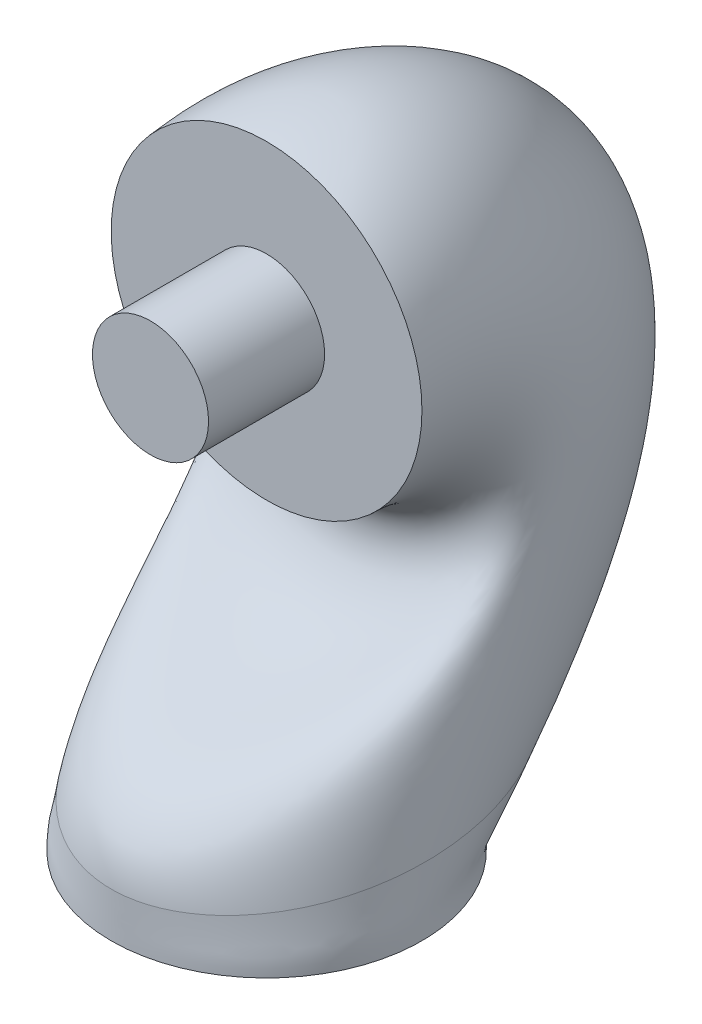
ISO-10303-21;
HEADER;
FILE_DESCRIPTION(('STEP AP214'),'2;1');
FILE_NAME('part.step','',(''),(''),'','','');
FILE_SCHEMA(('AUTOMOTIVE_DESIGN { 1 0 10303 214 1 1 1 1 }'));
ENDSEC;
DATA;
#1=APPLICATION_CONTEXT('core data for automotive mechanical design processes');
#2=APPLICATION_PROTOCOL_DEFINITION('international standard','automotive_design',2000,#1);
#3=PRODUCT_CONTEXT('',#1,'mechanical');
#4=PRODUCT('Part','Part','',(#3));
#5=PRODUCT_RELATED_PRODUCT_CATEGORY('part','',(#4));
#6=PRODUCT_DEFINITION_FORMATION('','',#4);
#7=PRODUCT_DEFINITION_CONTEXT('part definition',#1,'design');
#8=PRODUCT_DEFINITION('design','',#6,#7);
#9=PRODUCT_DEFINITION_SHAPE('','',#8);
#10=(LENGTH_UNIT() NAMED_UNIT(*) SI_UNIT(.MILLI.,.METRE.));
#11=(NAMED_UNIT(*) PLANE_ANGLE_UNIT() SI_UNIT($,.RADIAN.));
#12=(NAMED_UNIT(*) SI_UNIT($,.STERADIAN.) SOLID_ANGLE_UNIT());
#13=UNCERTAINTY_MEASURE_WITH_UNIT(LENGTH_MEASURE(1.E-05),#10,'distance_accuracy_value','');
#14=(GEOMETRIC_REPRESENTATION_CONTEXT(3) GLOBAL_UNCERTAINTY_ASSIGNED_CONTEXT((#13)) GLOBAL_UNIT_ASSIGNED_CONTEXT((#10,
#11,#12)) REPRESENTATION_CONTEXT('',''));
#15=CARTESIAN_POINT('',(0.,0.,0.));
#16=DIRECTION('',(0.,0.,1.));
#17=DIRECTION('',(1.,0.,0.));
#18=AXIS2_PLACEMENT_3D('',#15,#16,#17);
#19=CARTESIAN_POINT('',(0.,200.99,0.));
#20=DIRECTION('',(0.,0.,1.));
#21=DIRECTION('',(1.,0.,0.));
#22=AXIS2_PLACEMENT_3D('',#19,#20,#21);
#23=PLANE('',#22);
#24=CARTESIAN_POINT('',(0.,200.99,0.));
#25=DIRECTION('',(0.,0.,1.));
#26=DIRECTION('',(1.,0.,0.));
#27=AXIS2_PLACEMENT_3D('',#24,#25,#26);
#28=CIRCLE('',#27,25.4);
#29=CARTESIAN_POINT('',(25.4,200.99,0.));
#30=VERTEX_POINT('',#29);
#31=EDGE_CURVE('E184',#30,#30,#28,.T.);
#32=ORIENTED_EDGE('',*,*,#31,.F.);
#33=EDGE_LOOP('',(#32));
#34=FACE_BOUND('',#33,.T.);
#35=CARTESIAN_POINT('',(0.,200.99,0.));
#36=DIRECTION('',(0.,0.,1.));
#37=DIRECTION('',(1.,0.,0.));
#38=AXIS2_PLACEMENT_3D('',#35,#36,#37);
#39=CIRCLE('',#38,68.);
#40=CARTESIAN_POINT('',(68.,200.99,0.));
#41=VERTEX_POINT('',#40);
#42=EDGE_CURVE('E12',#41,#41,#39,.T.);
#43=ORIENTED_EDGE('',*,*,#42,.T.);
#44=EDGE_LOOP('',(#43));
#45=FACE_BOUND('',#44,.T.);
#46=ADVANCED_FACE('F90',(#34,#45),#23,.T.);
#47=CARTESIAN_POINT('',(0.,0.,0.));
#48=DIRECTION('',(0.,1.,0.));
#49=DIRECTION('',(0.,0.,1.));
#50=AXIS2_PLACEMENT_3D('',#47,#48,#49);
#51=PLANE('',#50);
#52=CARTESIAN_POINT('',(0.,0.,0.));
#53=DIRECTION('',(0.,-1.,0.));
#54=DIRECTION('',(0.,0.,-1.));
#55=AXIS2_PLACEMENT_3D('',#52,#53,#54);
#56=CIRCLE('',#55,25.4);
#57=CARTESIAN_POINT('',(0.,0.,-25.4));
#58=VERTEX_POINT('',#57);
#59=EDGE_CURVE('E191',#58,#58,#56,.T.);
#60=ORIENTED_EDGE('',*,*,#59,.F.);
#61=EDGE_LOOP('',(#60));
#62=FACE_BOUND('',#61,.T.);
#63=CARTESIAN_POINT('',(0.,0.,0.));
#64=DIRECTION('',(0.,1.,0.));
#65=DIRECTION('',(0.,0.,1.));
#66=AXIS2_PLACEMENT_3D('',#63,#64,#65);
#67=CIRCLE('',#66,68.);
#68=CARTESIAN_POINT('',(0.,0.,68.));
#69=VERTEX_POINT('',#68);
#70=EDGE_CURVE('E103',#69,#69,#67,.T.);
#71=ORIENTED_EDGE('',*,*,#70,.F.);
#72=EDGE_LOOP('',(#71));
#73=FACE_BOUND('',#72,.T.);
#74=ADVANCED_FACE('F125',(#62,#73),#51,.F.);
#75=CARTESIAN_POINT('',(0.,40.1830339897278,-96.0895319256657));
#76=CARTESIAN_POINT('',(0.,85.6169492294122,-136.561514064275));
#77=CARTESIAN_POINT('',(0.,175.500807488298,-166.280522660287));
#78=CARTESIAN_POINT('',(0.,263.314951672969,-100.602527009767));
#79=CARTESIAN_POINT('',(0.,276.247121590629,-29.9456852514251));
#80=CARTESIAN_POINT('',(0.,268.99,0.));
#81=CARTESIAN_POINT('',(-4.45058955707017,40.1830339897278,-96.0895319256657));
#82=CARTESIAN_POINT('',(-4.45058955707017,85.6169492294122,-136.561514064275));
#83=CARTESIAN_POINT('',(-4.45058955707018,175.500807488298,-166.280522660287));
#84=CARTESIAN_POINT('',(-4.4505895570702,263.314951672969,-100.602527009767));
#85=CARTESIAN_POINT('',(-4.4505895570702,276.247121590629,-29.9456852514251));
#86=CARTESIAN_POINT('',(-4.45058955707021,268.99,0.));
#87=CARTESIAN_POINT('',(-13.3516971290209,40.036933827057,-94.9791059748546));
#88=CARTESIAN_POINT('',(-13.3516971290209,85.3304325369103,-135.131594699005));
#89=CARTESIAN_POINT('',(-13.351697129021,174.699350374713,-164.853039748497));
#90=CARTESIAN_POINT('',(-13.351697129021,262.003810315437,-100.135902480789));
#91=CARTESIAN_POINT('',(-13.351697129021,275.278048891622,-30.0318807760566));
#92=CARTESIAN_POINT('',(-13.351697129021,268.113554910038,0.));
#93=CARTESIAN_POINT('',(-26.1902773929208,39.4124524652334,-90.141064573548));
#94=CARTESIAN_POINT('',(-26.1902773929208,84.0987651464168,-129.003610806172));
#95=CARTESIAN_POINT('',(-26.1902773929208,171.284518433549,-158.79414153997));
#96=CARTESIAN_POINT('',(-26.1902773929209,256.400686083253,-98.1263898861048));
#97=CARTESIAN_POINT('',(-26.1902773929209,271.028080934237,-30.3606278441287));
#98=CARTESIAN_POINT('',(-26.1902773929209,264.218866368927,0.));
#99=CARTESIAN_POINT('',(-38.0223754946656,38.423503782077,-82.3826791433597));
#100=CARTESIAN_POINT('',(-38.0223754946656,82.1408770972173,-119.282238847177));
#101=CARTESIAN_POINT('',(-38.0223754946656,165.888139871942,-149.24404729991));
#102=CARTESIAN_POINT('',(-38.0223754946656,247.528597135227,-94.9282411677369));
#103=CARTESIAN_POINT('',(-38.0223754946656,264.183990341426,-30.8393963104029));
#104=CARTESIAN_POINT('',(-38.0223754946656,257.894548780521,0.));
#105=CARTESIAN_POINT('',(-48.3933075192374,37.1181618146429,-72.0411153085146));
#106=CARTESIAN_POINT('',(-48.3933075192374,79.5488928343094,-106.433060267412));
#107=CARTESIAN_POINT('',(-48.3933075192375,158.777276446469,-136.685590149981));
#108=CARTESIAN_POINT('',(-48.3933075192375,235.81932211697,-90.6903822562369));
#109=CARTESIAN_POINT('',(-48.3933075192376,255.031471100156,-31.4276134970264));
#110=CARTESIAN_POINT('',(-48.3933075192376,249.383311422279,0.));
#111=CARTESIAN_POINT('',(-56.9045112462352,35.5511033989887,-59.5314758417417));
#112=CARTESIAN_POINT('',(-56.9045112462352,76.4300034586772,-90.9911298037877));
#113=CARTESIAN_POINT('',(-56.9045112462351,150.251922318227,-121.653210754833));
#114=CARTESIAN_POINT('',(-56.9045112462351,221.763551128121,-85.5873675756419));
#115=CARTESIAN_POINT('',(-56.9045112462351,243.932643843936,-32.092820027114));
#116=CARTESIAN_POINT('',(-56.9045112462351,239.012403519171,0.));
#117=CARTESIAN_POINT('',(-63.2289105718552,33.7825667868715,-45.3345085371011));
#118=CARTESIAN_POINT('',(-63.2289105718552,72.9040904374828,-73.5500182640686));
#119=CARTESIAN_POINT('',(-63.2289105718552,140.639810004648,-104.724817859811));
#120=CARTESIAN_POINT('',(-63.2289105718553,205.901594298424,-79.8153379569059));
#121=CARTESIAN_POINT('',(-63.2289105718553,231.31400195968,-32.8093902074001));
#122=CARTESIAN_POINT('',(-63.2289105718553,227.180280733188,0.));
#123=CARTESIAN_POINT('',(-67.1234564131867,31.877187026382,-29.9828594470392));
#124=CARTESIAN_POINT('',(-67.1234564131867,69.1010681069449,-54.7495586416824));
#125=CARTESIAN_POINT('',(-67.1234564131866,130.290601673814,-86.5126856143312));
#126=CARTESIAN_POINT('',(-67.1234564131866,188.812990827742,-73.5875002155936));
#127=CARTESIAN_POINT('',(-67.1234564131866,217.652931251162,-33.5571009824889));
#128=CARTESIAN_POINT('',(-67.1234564131866,214.341693781057,0.));
#129=CARTESIAN_POINT('',(-68.438484371331,29.9026144472948,-14.0447659628329));
#130=CARTESIAN_POINT('',(-68.438484371331,65.1577312507736,-35.2613101030782));
#131=CARTESIAN_POINT('',(-68.438484371331,119.568998642528,-67.6526556395998));
#132=CARTESIAN_POINT('',(-68.438484371331,171.104182844263,-67.1287648594481));
#133=CARTESIAN_POINT('',(-68.438484371331,203.461719064277,-34.3194343753628));
#134=CARTESIAN_POINT('',(-68.438484371331,200.989999999999,0.));
#135=CARTESIAN_POINT('',(-67.1234564131866,27.9280418682081,1.89332752137353));
#136=CARTESIAN_POINT('',(-67.1234564131866,61.2143943946031,-15.7730615644738));
#137=CARTESIAN_POINT('',(-67.1234564131866,108.847395611244,-48.7926256648683));
#138=CARTESIAN_POINT('',(-67.1234564131866,153.395374860787,-60.6700295033025));
#139=CARTESIAN_POINT('',(-67.1234564131866,189.270506877397,-35.0817677682366));
#140=CARTESIAN_POINT('',(-67.1234564131866,187.638306218945,0.));
#141=CARTESIAN_POINT('',(-63.2289105718554,26.0226621077182,17.2449766114353));
#142=CARTESIAN_POINT('',(-63.2289105718554,57.4113720640644,3.02739805791228));
#143=CARTESIAN_POINT('',(-63.2289105718554,98.4981872804083,-30.5804934193886));
#144=CARTESIAN_POINT('',(-63.2289105718555,136.306771390102,-54.4421917619902));
#145=CARTESIAN_POINT('',(-63.2289105718555,175.609436168875,-35.8294785433254));
#146=CARTESIAN_POINT('',(-63.2289105718555,174.799719266809,0.));
#147=CARTESIAN_POINT('',(-56.904511246235,24.2541254956013,31.4419439160761));
#148=CARTESIAN_POINT('',(-56.904511246235,53.8854590428706,20.4685095976315));
#149=CARTESIAN_POINT('',(-56.9045112462349,88.8860749668305,-13.6521005243662));
#150=CARTESIAN_POINT('',(-56.9045112462349,120.444814560407,-48.6701621432541));
#151=CARTESIAN_POINT('',(-56.9045112462349,162.990794284621,-36.5460487236115));
#152=CARTESIAN_POINT('',(-56.9045112462349,162.96759648083,0.));
#153=CARTESIAN_POINT('',(-48.3933075192375,22.687067079947,43.951583382849));
#154=CARTESIAN_POINT('',(-48.3933075192375,50.7665696672381,35.9104400612552));
#155=CARTESIAN_POINT('',(-48.3933075192375,80.3607208385881,1.38027887078156));
#156=CARTESIAN_POINT('',(-48.3933075192375,106.389043571557,-43.5671474626592));
#157=CARTESIAN_POINT('',(-48.3933075192375,151.8919670284,-37.2112552536991));
#158=CARTESIAN_POINT('',(-48.3933075192376,152.59668857772,0.));
#159=CARTESIAN_POINT('',(-38.0223754946655,21.381725112513,54.293147217694));
#160=CARTESIAN_POINT('',(-38.0223754946655,48.1745854043305,48.7596186410204));
#161=CARTESIAN_POINT('',(-38.0223754946655,73.2498574131158,13.9387360207104));
#162=CARTESIAN_POINT('',(-38.0223754946656,94.679768553301,-39.3292885511592));
#163=CARTESIAN_POINT('',(-38.0223754946656,142.739447787131,-37.7994724403226));
#164=CARTESIAN_POINT('',(-38.0223754946656,144.08545121948,0.));
#165=CARTESIAN_POINT('',(-26.1902773929209,20.3927764293566,62.0515326478822));
#166=CARTESIAN_POINT('',(-26.1902773929209,46.2166973551309,58.4809906000152));
#167=CARTESIAN_POINT('',(-26.1902773929209,67.8534788515089,23.4888302607699));
#168=CARTESIAN_POINT('',(-26.1902773929209,85.807679605274,-36.1311398327913));
#169=CARTESIAN_POINT('',(-26.1902773929209,135.89535719432,-38.2782409065967));
#170=CARTESIAN_POINT('',(-26.1902773929209,137.761133631073,0.));
#171=CARTESIAN_POINT('',(-13.351697129021,19.7682950675328,66.889574049189));
#172=CARTESIAN_POINT('',(-13.3516971290211,44.9850299646373,64.608974492849));
#173=CARTESIAN_POINT('',(-13.3516971290211,64.4386469103445,29.5477284692972));
#174=CARTESIAN_POINT('',(-13.3516971290212,80.2045553730899,-34.1216272381066));
#175=CARTESIAN_POINT('',(-13.3516971290212,131.645389236934,-38.6069879746688));
#176=CARTESIAN_POINT('',(-13.3516971290212,133.866445089962,0.));
#177=CARTESIAN_POINT('',(-4.4505895570702,19.6221949048621,68.));
#178=CARTESIAN_POINT('',(-4.4505895570702,44.6985132721355,66.0388938581191));
#179=CARTESIAN_POINT('',(-4.4505895570702,63.6371897967597,30.9752113810878));
#180=CARTESIAN_POINT('',(-4.4505895570702,78.8934140155578,-33.6550027091293));
#181=CARTESIAN_POINT('',(-4.4505895570702,130.676316537927,-38.6931834993003));
#182=CARTESIAN_POINT('',(-4.45058955707021,132.99,0.));
#183=CARTESIAN_POINT('',(4.45058955707018,19.6221949048621,68.));
#184=CARTESIAN_POINT('',(4.45058955707018,44.6985132721355,66.0388938581191));
#185=CARTESIAN_POINT('',(4.45058955707018,63.6371897967597,30.9752113810878));
#186=CARTESIAN_POINT('',(4.45058955707019,78.8934140155578,-33.6550027091293));
#187=CARTESIAN_POINT('',(4.45058955707019,130.676316537927,-38.6931834993003));
#188=CARTESIAN_POINT('',(4.45058955707018,132.99,0.));
#189=CARTESIAN_POINT('',(13.351697129021,19.7682950675328,66.8895740491891));
#190=CARTESIAN_POINT('',(13.351697129021,44.9850299646373,64.6089744928491));
#191=CARTESIAN_POINT('',(13.351697129021,64.4386469103444,29.5477284692972));
#192=CARTESIAN_POINT('',(13.351697129021,80.2045553730896,-34.1216272381066));
#193=CARTESIAN_POINT('',(13.3516971290209,131.645389236933,-38.6069879746688));
#194=CARTESIAN_POINT('',(13.3516971290209,133.866445089962,0.));
#195=CARTESIAN_POINT('',(26.1902773929206,20.3927764293566,62.051532647882));
#196=CARTESIAN_POINT('',(26.1902773929207,46.2166973551309,58.480990600015));
#197=CARTESIAN_POINT('',(26.1902773929207,67.853478851509,23.4888302607698));
#198=CARTESIAN_POINT('',(26.1902773929208,85.8076796052742,-36.1311398327914));
#199=CARTESIAN_POINT('',(26.1902773929208,135.89535719432,-38.2782409065967));
#200=CARTESIAN_POINT('',(26.1902773929208,137.761133631074,0.));
#201=CARTESIAN_POINT('',(38.0223754946657,21.3817251125129,54.2931472176944));
#202=CARTESIAN_POINT('',(38.0223754946657,48.1745854043304,48.7596186410207));
#203=CARTESIAN_POINT('',(38.0223754946657,73.2498574131156,13.9387360207106));
#204=CARTESIAN_POINT('',(38.0223754946656,94.6797685533006,-39.3292885511591));
#205=CARTESIAN_POINT('',(38.0223754946656,142.739447787131,-37.7994724403225));
#206=CARTESIAN_POINT('',(38.0223754946655,144.085451219479,0.));
#207=CARTESIAN_POINT('',(48.3933075192373,22.687067079947,43.9515833828487));
#208=CARTESIAN_POINT('',(48.3933075192373,50.7665696672381,35.910440061255));
#209=CARTESIAN_POINT('',(48.3933075192374,80.3607208385883,1.38027887078134));
#210=CARTESIAN_POINT('',(48.3933075192374,106.389043571557,-43.5671474626593));
#211=CARTESIAN_POINT('',(48.3933075192375,151.8919670284,-37.2112552536991));
#212=CARTESIAN_POINT('',(48.3933075192375,152.596688577721,0.));
#213=CARTESIAN_POINT('',(56.9045112462352,24.2541254956013,31.4419439160763));
#214=CARTESIAN_POINT('',(56.9045112462352,53.8854590428707,20.4685095976317));
#215=CARTESIAN_POINT('',(56.9045112462351,88.8860749668305,-13.6521005243661));
#216=CARTESIAN_POINT('',(56.9045112462351,120.444814560407,-48.6701621432541));
#217=CARTESIAN_POINT('',(56.9045112462351,162.990794284621,-36.5460487236114));
#218=CARTESIAN_POINT('',(56.904511246235,162.96759648083,0.));
#219=CARTESIAN_POINT('',(63.2289105718551,26.0226621077182,17.2449766114353));
#220=CARTESIAN_POINT('',(63.2289105718551,57.4113720640644,3.02739805791222));
#221=CARTESIAN_POINT('',(63.2289105718552,98.4981872804084,-30.5804934193887));
#222=CARTESIAN_POINT('',(63.2289105718553,136.306771390102,-54.4421917619903));
#223=CARTESIAN_POINT('',(63.2289105718553,175.609436168875,-35.8294785433254));
#224=CARTESIAN_POINT('',(63.2289105718554,174.799719266809,0.));
#225=CARTESIAN_POINT('',(67.1234564131868,27.928041868208,1.89332752137361));
#226=CARTESIAN_POINT('',(67.1234564131868,61.214394394603,-15.7730615644738));
#227=CARTESIAN_POINT('',(67.1234564131867,108.847395611244,-48.7926256648683));
#228=CARTESIAN_POINT('',(67.1234564131866,153.395374860786,-60.6700295033025));
#229=CARTESIAN_POINT('',(67.1234564131865,189.270506877396,-35.0817677682366));
#230=CARTESIAN_POINT('',(67.1234564131865,187.638306218945,0.));
#231=CARTESIAN_POINT('',(68.4384843713309,29.9026144472949,-14.0447659628328));
#232=CARTESIAN_POINT('',(68.4384843713309,65.1577312507737,-35.2613101030782));
#233=CARTESIAN_POINT('',(68.4384843713309,119.568998642529,-67.6526556395999));
#234=CARTESIAN_POINT('',(68.438484371331,171.104182844263,-67.1287648594481));
#235=CARTESIAN_POINT('',(68.4384843713311,203.461719064278,-34.3194343753627));
#236=CARTESIAN_POINT('',(68.4384843713311,200.99,0.));
#237=CARTESIAN_POINT('',(67.1234564131867,31.877187026382,-29.9828594470391));
#238=CARTESIAN_POINT('',(67.1234564131867,69.1010681069448,-54.7495586416824));
#239=CARTESIAN_POINT('',(67.1234564131866,130.290601673814,-86.5126856143312));
#240=CARTESIAN_POINT('',(67.1234564131866,188.812990827742,-73.5875002155937));
#241=CARTESIAN_POINT('',(67.1234564131865,217.652931251161,-33.5571009824889));
#242=CARTESIAN_POINT('',(67.1234564131865,214.341693781057,0.));
#243=CARTESIAN_POINT('',(63.2289105718552,33.7825667868716,-45.334508537101));
#244=CARTESIAN_POINT('',(63.2289105718553,72.9040904374831,-73.5500182640686));
#245=CARTESIAN_POINT('',(63.2289105718553,140.639810004649,-104.724817859811));
#246=CARTESIAN_POINT('',(63.2289105718554,205.901594298424,-79.815337956906));
#247=CARTESIAN_POINT('',(63.2289105718555,231.314001959681,-32.8093902074001));
#248=CARTESIAN_POINT('',(63.2289105718555,227.18028073319,0.));
#249=CARTESIAN_POINT('',(56.9045112462353,35.5511033989886,-59.5314758417416));
#250=CARTESIAN_POINT('',(56.9045112462352,76.4300034586771,-90.9911298037876));
#251=CARTESIAN_POINT('',(56.9045112462351,150.251922318227,-121.653210754833));
#252=CARTESIAN_POINT('',(56.904511246235,221.76355112812,-85.587367575642));
#253=CARTESIAN_POINT('',(56.9045112462349,243.932643843936,-32.092820027114));
#254=CARTESIAN_POINT('',(56.9045112462349,239.01240351917,0.));
#255=CARTESIAN_POINT('',(48.3933075192374,37.118161814643,-72.0411153085143));
#256=CARTESIAN_POINT('',(48.3933075192374,79.5488928343096,-106.433060267411));
#257=CARTESIAN_POINT('',(48.3933075192375,158.77727644647,-136.685590149981));
#258=CARTESIAN_POINT('',(48.3933075192375,235.819322116971,-90.6903822562369));
#259=CARTESIAN_POINT('',(48.3933075192376,255.031471100157,-31.4276134970264));
#260=CARTESIAN_POINT('',(48.3933075192376,249.38331142228,0.));
#261=CARTESIAN_POINT('',(38.0223754946659,38.4235037820769,-82.3826791433598));
#262=CARTESIAN_POINT('',(38.0223754946659,82.140877097217,-119.282238847177));
#263=CARTESIAN_POINT('',(38.0223754946658,165.888139871941,-149.24404729991));
#264=CARTESIAN_POINT('',(38.0223754946656,247.528597135226,-94.928241167737));
#265=CARTESIAN_POINT('',(38.0223754946655,264.183990341425,-30.8393963104029));
#266=CARTESIAN_POINT('',(38.0223754946655,257.89454878052,0.));
#267=CARTESIAN_POINT('',(26.1902773929207,39.4124524652334,-90.1410645735476));
#268=CARTESIAN_POINT('',(26.1902773929207,84.0987651464169,-129.003610806171));
#269=CARTESIAN_POINT('',(26.1902773929208,171.284518433549,-158.794141539969));
#270=CARTESIAN_POINT('',(26.1902773929208,256.400686083254,-98.1263898861048));
#271=CARTESIAN_POINT('',(26.1902773929209,271.028080934238,-30.3606278441287));
#272=CARTESIAN_POINT('',(26.1902773929209,264.218866368928,0.));
#273=CARTESIAN_POINT('',(13.3516971290213,40.036933827057,-94.9791059748548));
#274=CARTESIAN_POINT('',(13.3516971290213,85.3304325369102,-135.131594699005));
#275=CARTESIAN_POINT('',(13.3516971290212,174.699350374713,-164.853039748497));
#276=CARTESIAN_POINT('',(13.3516971290211,262.003810315437,-100.13590248079));
#277=CARTESIAN_POINT('',(13.3516971290211,275.278048891622,-30.0318807760566));
#278=CARTESIAN_POINT('',(13.351697129021,268.113554910037,0.));
#279=CARTESIAN_POINT('',(4.45058955707022,40.1830339897278,-96.0895319256657));
#280=CARTESIAN_POINT('',(4.45058955707022,85.6169492294122,-136.561514064275));
#281=CARTESIAN_POINT('',(4.45058955707022,175.500807488298,-166.280522660287));
#282=CARTESIAN_POINT('',(4.4505895570702,263.314951672969,-100.602527009767));
#283=CARTESIAN_POINT('',(4.4505895570702,276.247121590629,-29.9456852514251));
#284=CARTESIAN_POINT('',(4.4505895570702,268.99,0.));
#285=CARTESIAN_POINT('',(0.,40.1830339897278,-96.0895319256657));
#286=CARTESIAN_POINT('',(0.,85.6169492294122,-136.561514064275));
#287=CARTESIAN_POINT('',(0.,175.500807488298,-166.280522660287));
#288=CARTESIAN_POINT('',(0.,263.314951672969,-100.602527009767));
#289=CARTESIAN_POINT('',(0.,276.247121590629,-29.9456852514251));
#290=CARTESIAN_POINT('',(0.,268.99,0.));
#291=B_SPLINE_SURFACE_WITH_KNOTS('',3,3,((#75,#76,#77,#78,#79,#80),(#81,#82,#83,#84,#85,#86),
(#87,#88,#89,#90,#91,#92),(#93,#94,#95,#96,#97,#98),(#99,#100,#101,#102,#103,#104),(#105,#106,
#107,#108,#109,#110),(#111,#112,#113,#114,#115,#116),(#117,#118,#119,#120,#121,#122),(#123,#124,
#125,#126,#127,#128),(#129,#130,#131,#132,#133,#134),(#135,#136,#137,#138,#139,#140),(#141,#142,
#143,#144,#145,#146),(#147,#148,#149,#150,#151,#152),(#153,#154,#155,#156,#157,#158),(#159,#160,
#161,#162,#163,#164),(#165,#166,#167,#168,#169,#170),(#171,#172,#173,#174,#175,#176),(#177,#178,
#179,#180,#181,#182),(#183,#184,#185,#186,#187,#188),(#189,#190,#191,#192,#193,#194),(#195,#196,
#197,#198,#199,#200),(#201,#202,#203,#204,#205,#206),(#207,#208,#209,#210,#211,#212),(#213,#214,
#215,#216,#217,#218),(#219,#220,#221,#222,#223,#224),(#225,#226,#227,#228,#229,#230),(#231,#232,
#233,#234,#235,#236),(#237,#238,#239,#240,#241,#242),(#243,#244,#245,#246,#247,#248),(#249,#250,
#251,#252,#253,#254),(#255,#256,#257,#258,#259,#260),(#261,#262,#263,#264,#265,#266),(#267,#268,
#269,#270,#271,#272),(#273,#274,#275,#276,#277,#278),(#279,#280,#281,#282,#283,#284),(#285,#286,
#287,#288,#289,#290)),.UNSPECIFIED.,.T.,.F.,.F.,(4,1,1,1,1,1,1,1,1,1,1,1,1,1,1,1,2,1,1,1,1,1,1,
1,1,1,1,1,1,1,1,1,4),(4,1,1,4),(0.,0.03125,0.0625,0.09375,0.125,0.15625,0.1875,0.21875,0.25,
0.28125,0.3125,0.34375,0.375,0.40625,0.4375,0.46875,0.5,0.53125,0.5625,0.59375,0.625,0.65625,
0.6875,0.71875,0.75,0.78125,0.8125,0.84375,0.875,0.90625,0.9375,0.96875,1.),(0.0781027099836669,
0.378452682969865,0.712089921738431,1.),.UNSPECIFIED.);
#292=CARTESIAN_POINT('',(0.,40.1830339897278,-96.0895319256657));
#293=CARTESIAN_POINT('',(-4.45058955707017,40.1830339897278,-96.0895319256657));
#294=CARTESIAN_POINT('',(-13.3516971290209,40.036933827057,-94.9791059748546));
#295=CARTESIAN_POINT('',(-26.1902773929208,39.4124524652334,-90.141064573548));
#296=CARTESIAN_POINT('',(-38.0223754946656,38.423503782077,-82.3826791433597));
#297=CARTESIAN_POINT('',(-48.3933075192374,37.1181618146429,-72.0411153085146));
#298=CARTESIAN_POINT('',(-56.9045112462352,35.5511033989887,-59.5314758417417));
#299=CARTESIAN_POINT('',(-63.2289105718552,33.7825667868715,-45.3345085371011));
#300=CARTESIAN_POINT('',(-67.1234564131867,31.877187026382,-29.9828594470392));
#301=CARTESIAN_POINT('',(-68.438484371331,29.9026144472948,-14.0447659628329));
#302=CARTESIAN_POINT('',(-67.1234564131866,27.9280418682081,1.89332752137353));
#303=CARTESIAN_POINT('',(-63.2289105718554,26.0226621077182,17.2449766114353));
#304=CARTESIAN_POINT('',(-56.904511246235,24.2541254956013,31.4419439160761));
#305=CARTESIAN_POINT('',(-48.3933075192375,22.687067079947,43.951583382849));
#306=CARTESIAN_POINT('',(-38.0223754946655,21.381725112513,54.293147217694));
#307=CARTESIAN_POINT('',(-26.1902773929209,20.3927764293566,62.0515326478822));
#308=CARTESIAN_POINT('',(-13.351697129021,19.7682950675328,66.889574049189));
#309=CARTESIAN_POINT('',(-4.4505895570702,19.6221949048621,68.));
#310=CARTESIAN_POINT('',(4.45058955707018,19.6221949048621,68.));
#311=CARTESIAN_POINT('',(13.351697129021,19.7682950675328,66.8895740491891));
#312=CARTESIAN_POINT('',(26.1902773929206,20.3927764293566,62.051532647882));
#313=CARTESIAN_POINT('',(38.0223754946657,21.3817251125129,54.2931472176944));
#314=CARTESIAN_POINT('',(48.3933075192373,22.687067079947,43.9515833828487));
#315=CARTESIAN_POINT('',(56.9045112462352,24.2541254956013,31.4419439160763));
#316=CARTESIAN_POINT('',(63.2289105718551,26.0226621077182,17.2449766114353));
#317=CARTESIAN_POINT('',(67.1234564131868,27.928041868208,1.89332752137361));
#318=CARTESIAN_POINT('',(68.4384843713309,29.9026144472949,-14.0447659628328));
#319=CARTESIAN_POINT('',(67.1234564131867,31.877187026382,-29.9828594470391));
#320=CARTESIAN_POINT('',(63.2289105718552,33.7825667868716,-45.334508537101));
#321=CARTESIAN_POINT('',(56.9045112462353,35.5511033989886,-59.5314758417416));
#322=CARTESIAN_POINT('',(48.3933075192374,37.118161814643,-72.0411153085143));
#323=CARTESIAN_POINT('',(38.0223754946659,38.4235037820769,-82.3826791433598));
#324=CARTESIAN_POINT('',(26.1902773929207,39.4124524652334,-90.1410645735476));
#325=CARTESIAN_POINT('',(13.3516971290213,40.036933827057,-94.9791059748548));
#326=CARTESIAN_POINT('',(4.45058955707022,40.1830339897278,-96.0895319256657));
#327=CARTESIAN_POINT('',(0.,40.1830339897278,-96.0895319256657));
#328=B_SPLINE_CURVE_WITH_KNOTS('',3,(#292,#293,#294,#295,#296,#297,#298,#299,#300,#301,#302,
#303,#304,#305,#306,#307,#308,#309,#310,#311,#312,#313,#314,#315,#316,#317,#318,#319,#320,#321,
#322,#323,#324,#325,#326,#327),.UNSPECIFIED.,.T.,.F.,(4,1,1,1,1,1,1,1,1,1,1,1,1,1,1,1,2,1,1,1,1,
1,1,1,1,1,1,1,1,1,1,1,4),(0.,0.03125,0.0625,0.09375,0.125,0.15625,0.1875,0.21875,0.25,0.28125,
0.3125,0.34375,0.375,0.40625,0.4375,0.46875,0.5,0.53125,0.5625,0.59375,0.625,0.65625,0.6875,
0.71875,0.75,0.78125,0.8125,0.84375,0.875,0.90625,0.9375,0.96875,1.),.UNSPECIFIED.);
#329=CARTESIAN_POINT('',(0.,40.1830339897278,-96.0895319256657));
#330=VERTEX_POINT('',#329);
#331=EDGE_CURVE('E98',#330,#330,#328,.T.);
#332=ORIENTED_EDGE('',*,*,#42,.F.);
#333=EDGE_LOOP('',(#332));
#334=FACE_BOUND('',#333,.T.);
#335=ORIENTED_EDGE('',*,*,#331,.T.);
#336=EDGE_LOOP('',(#335));
#337=FACE_BOUND('',#336,.T.);
#338=ADVANCED_FACE('F135',(#334,#337),#291,.T.);
#339=CARTESIAN_POINT('',(0.,0.,-68.));
#340=CARTESIAN_POINT('',(0.,1.10714232228488,-68.));
#341=CARTESIAN_POINT('',(0.,2.21428464456976,-68.));
#342=CARTESIAN_POINT('',(0.,8.84430999769066,-68.));
#343=CARTESIAN_POINT('',(0.,14.1220632977414,-70.2842304197581));
#344=CARTESIAN_POINT('',(0.,25.3933227602918,-82.2895332595347));
#345=CARTESIAN_POINT('',(0.,32.8255689072563,-89.5355910242017));
#346=CARTESIAN_POINT('',(0.,40.1830339897278,-96.0895319256657));
#347=CARTESIAN_POINT('',(-4.45058955707016,0.,-68.));
#348=CARTESIAN_POINT('',(-4.45058955707017,1.10714232228488,-68.));
#349=CARTESIAN_POINT('',(-4.45058955707017,2.21428464456976,-68.));
#350=CARTESIAN_POINT('',(-4.45058955707017,8.84430999769066,-68.));
#351=CARTESIAN_POINT('',(-4.45058955707017,14.1220632977414,-70.2842304197581));
#352=CARTESIAN_POINT('',(-4.45058955707017,25.3933227602918,-82.2895332595347));
#353=CARTESIAN_POINT('',(-4.45058955707017,32.8255689072563,-89.5355910242017));
#354=CARTESIAN_POINT('',(-4.45058955707017,40.1830339897278,-96.0895319256657));
#355=CARTESIAN_POINT('',(-13.3516971290209,0.,-67.1235549100379));
#356=CARTESIAN_POINT('',(-13.3516971290209,1.10201706774661,-67.1232497621119));
#357=CARTESIAN_POINT('',(-13.3516971290209,2.20403413549322,-67.1229446141859));
#358=CARTESIAN_POINT('',(-13.3516971290209,8.80336734827593,-67.1211172624128));
#359=CARTESIAN_POINT('',(-13.3516971290209,14.0574688385485,-69.3859799281694));
#360=CARTESIAN_POINT('',(-13.3516971290209,25.2930905551512,-81.2929526898763));
#361=CARTESIAN_POINT('',(-13.3516971290209,32.7021106098174,-88.4793841824701));
#362=CARTESIAN_POINT('',(-13.3516971290209,40.036933827057,-94.9791059748546));
#363=CARTESIAN_POINT('',(-26.1902773929208,0.,-63.2288663689267));
#364=CARTESIAN_POINT('',(-26.1902773929208,1.08041722776618,-63.2277606508161));
#365=CARTESIAN_POINT('',(-26.1902773929208,2.16083445553237,-63.2266549327055));
#366=CARTESIAN_POINT('',(-26.1902773929208,8.63081890816829,-63.22003343612));
#367=CARTESIAN_POINT('',(-26.1902773929208,13.7850711668643,-65.407289632862));
#368=CARTESIAN_POINT('',(-26.1902773929208,24.8668726161736,-76.9154653877904));
#369=CARTESIAN_POINT('',(-26.1902773929208,32.1755559910924,-83.8604675570991));
#370=CARTESIAN_POINT('',(-26.1902773929208,39.4124524652334,-90.141064573548));
#371=CARTESIAN_POINT('',(-38.0223754946656,0.,-56.9045487805205));
#372=CARTESIAN_POINT('',(-38.0223754946656,1.04653501185667,-56.9027064626098));
#373=CARTESIAN_POINT('',(-38.0223754946656,2.09307002371334,-56.9008641446991));
#374=CARTESIAN_POINT('',(-38.0223754946656,8.36015377787681,-56.8898315843764));
#375=CARTESIAN_POINT('',(-38.0223754946656,13.3575961636486,-58.9596479349473));
#376=CARTESIAN_POINT('',(-38.0223754946656,24.1942289853922,-69.8589474393301));
#377=CARTESIAN_POINT('',(-38.0223754946656,31.3428976103495,-76.4357805357321));
#378=CARTESIAN_POINT('',(-38.0223754946656,38.423503782077,-82.3826791433597));
#379=CARTESIAN_POINT('',(-48.3933075192374,0.,-48.3933114222796));
#380=CARTESIAN_POINT('',(-48.3933075192374,1.00215141169702,-48.3910518841985));
#381=CARTESIAN_POINT('',(-48.3933075192374,2.00430282339405,-48.3887923461173));
#382=CARTESIAN_POINT('',(-48.3933075192374,8.00559925428555,-48.3752612991482));
#383=CARTESIAN_POINT('',(-48.3933075192374,12.7974372941245,-50.2957705944696));
#384=CARTESIAN_POINT('',(-48.3933075192374,23.3088204202179,-60.4150852463587));
#385=CARTESIAN_POINT('',(-48.3933075192374,30.2451124073967,-66.5207629744744));
#386=CARTESIAN_POINT('',(-48.3933075192374,37.1181618146429,-72.0411153085146));
#387=CARTESIAN_POINT('',(-56.9045112462352,0.,-38.0224035191702));
#388=CARTESIAN_POINT('',(-56.9045112462352,0.949186072601536,-38.0201628961581));
#389=CARTESIAN_POINT('',(-56.9045112462352,1.89837214520308,-38.0179222731459));
#390=CARTESIAN_POINT('',(-56.9045112462352,7.58249025676613,-38.0045044974199));
#391=CARTESIAN_POINT('',(-56.9045112462352,12.1287873075843,-39.7511140349104));
#392=CARTESIAN_POINT('',(-56.9045112462352,22.2481692414963,-48.9562435948108));
#393=CARTESIAN_POINT('',(-56.9045112462352,28.9284095032603,-54.5101624957193));
#394=CARTESIAN_POINT('',(-56.9045112462352,35.5511033989887,-59.5314758417417));
#395=CARTESIAN_POINT('',(-63.2289105718552,0.,-26.1902807331902));
#396=CARTESIAN_POINT('',(-63.2289105718552,0.889675425281712,-26.1884951306991));
#397=CARTESIAN_POINT('',(-63.2289105718552,1.77935085056343,-26.186709528208));
#398=CARTESIAN_POINT('',(-63.2289105718552,7.10709463466261,-26.1760166032352));
#399=CARTESIAN_POINT('',(-63.2289105718552,11.3773544570733,-27.7308256130293));
#400=CARTESIAN_POINT('',(-63.2289105718552,21.053050293662,-35.9227411840631));
#401=CARTESIAN_POINT('',(-63.2289105718552,27.4434049886113,-40.8655261892464));
#402=CARTESIAN_POINT('',(-63.2289105718552,33.7825667868715,-45.3345085371011));
#403=CARTESIAN_POINT('',(-67.1234564131867,0.,-13.3516937810559));
#404=CARTESIAN_POINT('',(-67.1234564131867,0.825748229746855,-13.3507069454528));
#405=CARTESIAN_POINT('',(-67.1234564131867,1.65149645949371,-13.3497201098496));
#406=CARTESIAN_POINT('',(-67.1234564131867,6.59641780187165,-13.343810530804));
#407=CARTESIAN_POINT('',(-67.1234564131867,10.570045136849,-14.6951495990929));
#408=CARTESIAN_POINT('',(-67.1234564131867,19.7668098318418,-21.8086203575199));
#409=CARTESIAN_POINT('',(-67.1234564131867,25.8441990576333,-26.1012120960424));
#410=CARTESIAN_POINT('',(-67.1234564131867,31.877187026382,-29.9828594470392));
#411=CARTESIAN_POINT('',(-68.438484371331,0.,0.));
#412=CARTESIAN_POINT('',(-68.438484371331,0.759596564572654,0.));
#413=CARTESIAN_POINT('',(-68.438484371331,1.51919312914531,0.));
#414=CARTESIAN_POINT('',(-68.438484371331,6.06797098714179,0.));
#415=CARTESIAN_POINT('',(-68.438484371331,9.73458741517296,-1.14211520987908));
#416=CARTESIAN_POINT('',(-68.438484371331,18.434557560495,-7.14476662976739));
#417=CARTESIAN_POINT('',(-68.438484371331,24.1872812700183,-10.7677955121002));
#418=CARTESIAN_POINT('',(-68.438484371331,29.9026144472948,-14.0447659628329));
#419=CARTESIAN_POINT('',(-67.1234564131866,0.,13.351693781056));
#420=CARTESIAN_POINT('',(-67.1234564131866,0.693444899398462,13.3507069454528));
#421=CARTESIAN_POINT('',(-67.1234564131866,1.38688979879693,13.3497201098497));
#422=CARTESIAN_POINT('',(-67.1234564131866,5.539524172412,13.3438105308041));
#423=CARTESIAN_POINT('',(-67.1234564131866,8.89912969349708,12.4109191793349));
#424=CARTESIAN_POINT('',(-67.1234564131866,17.1023052891484,7.51908709798523));
#425=CARTESIAN_POINT('',(-67.1234564131866,22.5303634824035,4.56562107184208));
#426=CARTESIAN_POINT('',(-67.1234564131866,27.9280418682081,1.89332752137353));
#427=CARTESIAN_POINT('',(-63.2289105718554,0.,26.1902807331901));
#428=CARTESIAN_POINT('',(-63.2289105718554,0.629517703863596,26.188495130699));
#429=CARTESIAN_POINT('',(-63.2289105718554,1.25903540772719,26.186709528208));
#430=CARTESIAN_POINT('',(-63.2289105718554,5.02884733962097,26.1760166032352));
#431=CARTESIAN_POINT('',(-63.2289105718554,8.09182037327259,25.4465951932712));
#432=CARTESIAN_POINT('',(-63.2289105718554,15.8160648273279,21.6332079245284));
#433=CARTESIAN_POINT('',(-63.2289105718554,20.9311575514252,19.329935165046));
#434=CARTESIAN_POINT('',(-63.2289105718554,26.0226621077182,17.2449766114353));
#435=CARTESIAN_POINT('',(-56.904511246235,0.,38.0224035191702));
#436=CARTESIAN_POINT('',(-56.904511246235,0.570007056543779,38.0201628961581));
#437=CARTESIAN_POINT('',(-56.904511246235,1.14001411308756,38.017922273146));
#438=CARTESIAN_POINT('',(-56.904511246235,4.5534517175175,38.0045044974199));
#439=CARTESIAN_POINT('',(-56.904511246235,7.34038752276174,37.4668836151524));
#440=CARTESIAN_POINT('',(-56.904511246235,14.6209458794938,34.6667103352761));
#441=CARTESIAN_POINT('',(-56.904511246235,19.4461530367765,32.974571471519));
#442=CARTESIAN_POINT('',(-56.904511246235,24.2541254956013,31.4419439160761));
#443=CARTESIAN_POINT('',(-48.3933075192375,0.,48.3933114222796));
#444=CARTESIAN_POINT('',(-48.3933075192375,0.517041717448289,48.3910518841985));
#445=CARTESIAN_POINT('',(-48.3933075192375,1.03408343489658,48.3887923461173));
#446=CARTESIAN_POINT('',(-48.3933075192375,4.13034271999805,48.3752612991482));
#447=CARTESIAN_POINT('',(-48.3933075192375,6.67173753622147,48.0115401747116));
#448=CARTESIAN_POINT('',(-48.3933075192375,13.5602947007721,46.125551986824));
#449=CARTESIAN_POINT('',(-48.3933075192375,18.12945013264,44.9851719502741));
#450=CARTESIAN_POINT('',(-48.3933075192375,22.687067079947,43.951583382849));
#451=CARTESIAN_POINT('',(-38.0223754946655,0.,56.9045487805206));
#452=CARTESIAN_POINT('',(-38.0223754946655,0.472658117288648,56.9027064626099));
#453=CARTESIAN_POINT('',(-38.0223754946655,0.945316234577297,56.9008641446992));
#454=CARTESIAN_POINT('',(-38.0223754946655,3.77578819640681,56.8898315843764));
#455=CARTESIAN_POINT('',(-38.0223754946655,6.11157866669743,56.6754175151893));
#456=CARTESIAN_POINT('',(-38.0223754946655,12.6748861355979,55.5694141797954));
#457=CARTESIAN_POINT('',(-38.0223754946655,17.0316649296872,54.9001895115318));
#458=CARTESIAN_POINT('',(-38.0223754946655,21.381725112513,54.293147217694));
#459=CARTESIAN_POINT('',(-26.1902773929209,0.,63.2288663689265));
#460=CARTESIAN_POINT('',(-26.1902773929209,0.438775901379131,63.2277606508159));
#461=CARTESIAN_POINT('',(-26.1902773929209,0.877551802758263,63.2266549327053));
#462=CARTESIAN_POINT('',(-26.1902773929209,3.50512306611532,63.2200334361198));
#463=CARTESIAN_POINT('',(-26.1902773929209,5.68410366348173,63.1230592131038));
#464=CARTESIAN_POINT('',(-26.1902773929209,12.0022425048165,62.6259321282555));
#465=CARTESIAN_POINT('',(-26.1902773929209,16.1990065489443,62.3248765328986));
#466=CARTESIAN_POINT('',(-26.1902773929209,20.3927764293566,62.0515326478822));
#467=CARTESIAN_POINT('',(-13.351697129021,0.,67.123554910038));
#468=CARTESIAN_POINT('',(-13.351697129021,0.417176061398705,67.123249762112));
#469=CARTESIAN_POINT('',(-13.351697129021,0.83435212279741,67.1229446141861));
#470=CARTESIAN_POINT('',(-13.351697129021,3.33257462600769,67.1211172624129));
#471=CARTESIAN_POINT('',(-13.351697129021,5.4117059917975,67.1017495084114));
#472=CARTESIAN_POINT('',(-13.351697129021,11.5760245658389,67.0034194303417));
#473=CARTESIAN_POINT('',(-13.351697129021,15.6724519302193,66.9437931582699));
#474=CARTESIAN_POINT('',(-13.351697129021,19.7682950675328,66.889574049189));
#475=CARTESIAN_POINT('',(-4.4505895570702,0.,68.));
#476=CARTESIAN_POINT('',(-4.4505895570702,0.412050806860436,68.));
#477=CARTESIAN_POINT('',(-4.4505895570702,0.824101613720873,68.));
#478=CARTESIAN_POINT('',(-4.4505895570702,3.29163197659296,68.));
#479=CARTESIAN_POINT('',(-4.4505895570702,5.34711153260461,68.));
#480=CARTESIAN_POINT('',(-4.4505895570702,11.4757923606982,68.));
#481=CARTESIAN_POINT('',(-4.4505895570702,15.5489936327804,68.0000000000014));
#482=CARTESIAN_POINT('',(-4.4505895570702,19.6221949048621,68.));
#483=CARTESIAN_POINT('',(4.45058955707018,0.,68.));
#484=CARTESIAN_POINT('',(4.45058955707018,0.412050806860436,68.));
#485=CARTESIAN_POINT('',(4.45058955707018,0.824101613720873,68.));
#486=CARTESIAN_POINT('',(4.45058955707018,3.29163197659296,68.));
#487=CARTESIAN_POINT('',(4.45058955707018,5.34711153260461,68.));
#488=CARTESIAN_POINT('',(4.45058955707018,11.4757923606982,68.));
#489=CARTESIAN_POINT('',(4.45058955707018,15.5489936327804,68.0000000000014));
#490=CARTESIAN_POINT('',(4.45058955707018,19.6221949048621,68.));
#491=CARTESIAN_POINT('',(13.351697129021,0.,67.1235549100381));
#492=CARTESIAN_POINT('',(13.351697129021,0.417176061398705,67.1232497621121));
#493=CARTESIAN_POINT('',(13.351697129021,0.834352122797409,67.1229446141861));
#494=CARTESIAN_POINT('',(13.351697129021,3.33257462600768,67.121117262413));
#495=CARTESIAN_POINT('',(13.351697129021,5.41170599179749,67.1017495084115));
#496=CARTESIAN_POINT('',(13.351697129021,11.5760245658388,67.0034194303418));
#497=CARTESIAN_POINT('',(13.351697129021,15.6724519302193,66.9437931582699));
#498=CARTESIAN_POINT('',(13.351697129021,19.7682950675328,66.8895740491891));
#499=CARTESIAN_POINT('',(26.1902773929206,0.,63.2288663689263));
#500=CARTESIAN_POINT('',(26.1902773929206,0.438775901379132,63.2277606508157));
#501=CARTESIAN_POINT('',(26.1902773929206,0.877551802758264,63.2266549327051));
#502=CARTESIAN_POINT('',(26.1902773929206,3.50512306611533,63.2200334361196));
#503=CARTESIAN_POINT('',(26.1902773929206,5.68410366348174,63.1230592131036));
#504=CARTESIAN_POINT('',(26.1902773929206,12.0022425048165,62.6259321282553));
#505=CARTESIAN_POINT('',(26.1902773929206,16.1990065489443,62.3248765328984));
#506=CARTESIAN_POINT('',(26.1902773929206,20.3927764293566,62.051532647882));
#507=CARTESIAN_POINT('',(38.0223754946657,0.,56.9045487805209));
#508=CARTESIAN_POINT('',(38.0223754946657,0.472658117288647,56.9027064626102));
#509=CARTESIAN_POINT('',(38.0223754946657,0.945316234577296,56.9008641446995));
#510=CARTESIAN_POINT('',(38.0223754946657,3.7757881964068,56.8898315843768));
#511=CARTESIAN_POINT('',(38.0223754946657,6.11157866669742,56.6754175151896));
#512=CARTESIAN_POINT('',(38.0223754946657,12.6748861355978,55.5694141797957));
#513=CARTESIAN_POINT('',(38.0223754946657,17.0316649296872,54.9001895115321));
#514=CARTESIAN_POINT('',(38.0223754946657,21.3817251125129,54.2931472176944));
#515=CARTESIAN_POINT('',(48.3933075192373,0.,48.3933114222793));
#516=CARTESIAN_POINT('',(48.3933075192373,0.51704171744829,48.3910518841981));
#517=CARTESIAN_POINT('',(48.3933075192373,1.03408343489658,48.388792346117));
#518=CARTESIAN_POINT('',(48.3933075192373,4.13034271999805,48.3752612991478));
#519=CARTESIAN_POINT('',(48.3933075192373,6.67173753622147,48.0115401747112));
#520=CARTESIAN_POINT('',(48.3933075192373,13.5602947007721,46.1255519868236));
#521=CARTESIAN_POINT('',(48.3933075192373,18.12945013264,44.9851719502738));
#522=CARTESIAN_POINT('',(48.3933075192373,22.687067079947,43.9515833828487));
#523=CARTESIAN_POINT('',(56.9045112462352,0.,38.0224035191705));
#524=CARTESIAN_POINT('',(56.9045112462352,0.570007056543779,38.0201628961583));
#525=CARTESIAN_POINT('',(56.9045112462352,1.14001411308756,38.0179222731462));
#526=CARTESIAN_POINT('',(56.9045112462352,4.5534517175175,38.0045044974201));
#527=CARTESIAN_POINT('',(56.9045112462352,7.34038752276174,37.4668836151526));
#528=CARTESIAN_POINT('',(56.9045112462352,14.6209458794938,34.6667103352763));
#529=CARTESIAN_POINT('',(56.9045112462352,19.4461530367765,32.9745714715192));
#530=CARTESIAN_POINT('',(56.9045112462352,24.2541254956013,31.4419439160763));
#531=CARTESIAN_POINT('',(63.2289105718551,0.,26.19028073319));
#532=CARTESIAN_POINT('',(63.2289105718551,0.629517703863596,26.188495130699));
#533=CARTESIAN_POINT('',(63.2289105718551,1.2590354077272,26.1867095282079));
#534=CARTESIAN_POINT('',(63.2289105718551,5.02884733962097,26.1760166032351));
#535=CARTESIAN_POINT('',(63.2289105718551,8.09182037327259,25.4465951932711));
#536=CARTESIAN_POINT('',(63.2289105718551,15.8160648273279,21.6332079245283));
#537=CARTESIAN_POINT('',(63.2289105718551,20.9311575514252,19.3299351650459));
#538=CARTESIAN_POINT('',(63.2289105718551,26.0226621077182,17.2449766114353));
#539=CARTESIAN_POINT('',(67.1234564131868,0.,13.3516937810561));
#540=CARTESIAN_POINT('',(67.1234564131868,0.693444899398461,13.3507069454529));
#541=CARTESIAN_POINT('',(67.1234564131868,1.38688979879693,13.3497201098498));
#542=CARTESIAN_POINT('',(67.1234564131868,5.53952417241199,13.3438105308042));
#543=CARTESIAN_POINT('',(67.1234564131868,8.89912969349706,12.410919179335));
#544=CARTESIAN_POINT('',(67.1234564131868,17.1023052891483,7.51908709798529));
#545=CARTESIAN_POINT('',(67.1234564131868,22.5303634824035,4.56562107184216));
#546=CARTESIAN_POINT('',(67.1234564131868,27.928041868208,1.89332752137361));
#547=CARTESIAN_POINT('',(68.4384843713308,0.,0.));
#548=CARTESIAN_POINT('',(68.4384843713308,0.759596564572656,0.));
#549=CARTESIAN_POINT('',(68.4384843713308,1.51919312914532,0.));
#550=CARTESIAN_POINT('',(68.4384843713308,6.0679709871418,0.));
#551=CARTESIAN_POINT('',(68.4384843713308,9.73458741517298,-1.14211520987905));
#552=CARTESIAN_POINT('',(68.4384843713308,18.434557560495,-7.14476662976738));
#553=CARTESIAN_POINT('',(68.4384843713308,24.1872812700183,-10.7677955121002));
#554=CARTESIAN_POINT('',(68.4384843713309,29.9026144472949,-14.0447659628328));
#555=CARTESIAN_POINT('',(67.1234564131867,0.,-13.3516937810559));
#556=CARTESIAN_POINT('',(67.1234564131867,0.825748229746853,-13.3507069454527));
#557=CARTESIAN_POINT('',(67.1234564131867,1.65149645949371,-13.3497201098496));
#558=CARTESIAN_POINT('',(67.1234564131867,6.59641780187164,-13.343810530804));
#559=CARTESIAN_POINT('',(67.1234564131867,10.5700451368489,-14.6951495990929));
#560=CARTESIAN_POINT('',(67.1234564131867,19.7668098318418,-21.8086203575198));
#561=CARTESIAN_POINT('',(67.1234564131867,25.8441990576333,-26.1012120960423));
#562=CARTESIAN_POINT('',(67.1234564131867,31.877187026382,-29.9828594470391));
#563=CARTESIAN_POINT('',(63.2289105718552,0.,-26.1902807331901));
#564=CARTESIAN_POINT('',(63.2289105718552,0.889675425281715,-26.188495130699));
#565=CARTESIAN_POINT('',(63.2289105718552,1.77935085056344,-26.186709528208));
#566=CARTESIAN_POINT('',(63.2289105718552,7.10709463466263,-26.1760166032352));
#567=CARTESIAN_POINT('',(63.2289105718552,11.3773544570734,-27.7308256130292));
#568=CARTESIAN_POINT('',(63.2289105718552,21.0530502936621,-35.9227411840631));
#569=CARTESIAN_POINT('',(63.2289105718552,27.4434049886115,-40.8655261892463));
#570=CARTESIAN_POINT('',(63.2289105718552,33.7825667868716,-45.334508537101));
#571=CARTESIAN_POINT('',(56.9045112462353,0.,-38.0224035191701));
#572=CARTESIAN_POINT('',(56.9045112462353,0.949186072601535,-38.0201628961579));
#573=CARTESIAN_POINT('',(56.9045112462353,1.89837214520308,-38.0179222731458));
#574=CARTESIAN_POINT('',(56.9045112462353,7.58249025676612,-38.0045044974198));
#575=CARTESIAN_POINT('',(56.9045112462353,12.1287873075843,-39.7511140349103));
#576=CARTESIAN_POINT('',(56.9045112462353,22.2481692414963,-48.9562435948107));
#577=CARTESIAN_POINT('',(56.9045112462353,28.9284095032603,-54.5101624957192));
#578=CARTESIAN_POINT('',(56.9045112462353,35.5511033989886,-59.5314758417416));
#579=CARTESIAN_POINT('',(48.3933075192374,0.,-48.3933114222793));
#580=CARTESIAN_POINT('',(48.3933075192374,1.00215141169702,-48.3910518841982));
#581=CARTESIAN_POINT('',(48.3933075192374,2.00430282339406,-48.388792346117));
#582=CARTESIAN_POINT('',(48.3933075192374,8.00559925428557,-48.3752612991479));
#583=CARTESIAN_POINT('',(48.3933075192374,12.7974372941245,-50.2957705944694));
#584=CARTESIAN_POINT('',(48.3933075192374,23.308820420218,-60.4150852463584));
#585=CARTESIAN_POINT('',(48.3933075192374,30.2451124073968,-66.5207629744742));
#586=CARTESIAN_POINT('',(48.3933075192374,37.118161814643,-72.0411153085143));
#587=CARTESIAN_POINT('',(38.022375494666,0.,-56.9045487805207));
#588=CARTESIAN_POINT('',(38.0223754946659,1.04653501185666,-56.90270646261));
#589=CARTESIAN_POINT('',(38.0223754946659,2.09307002371333,-56.9008641446993));
#590=CARTESIAN_POINT('',(38.0223754946659,8.3601537778768,-56.8898315843765));
#591=CARTESIAN_POINT('',(38.0223754946659,13.3575961636485,-58.9596479349474));
#592=CARTESIAN_POINT('',(38.0223754946659,24.1942289853921,-69.8589474393302));
#593=CARTESIAN_POINT('',(38.0223754946659,31.3428976103495,-76.4357805357322));
#594=CARTESIAN_POINT('',(38.0223754946659,38.4235037820769,-82.3826791433598));
#595=CARTESIAN_POINT('',(26.1902773929207,0.,-63.2288663689263));
#596=CARTESIAN_POINT('',(26.1902773929207,1.08041722776618,-63.2277606508157));
#597=CARTESIAN_POINT('',(26.1902773929207,2.16083445553237,-63.2266549327051));
#598=CARTESIAN_POINT('',(26.1902773929207,8.6308189081683,-63.2200334361196));
#599=CARTESIAN_POINT('',(26.1902773929207,13.7850711668643,-65.4072896328616));
#600=CARTESIAN_POINT('',(26.1902773929207,24.8668726161736,-76.91546538779));
#601=CARTESIAN_POINT('',(26.1902773929207,32.1755559910925,-83.8604675570987));
#602=CARTESIAN_POINT('',(26.1902773929207,39.4124524652334,-90.1410645735476));
#603=CARTESIAN_POINT('',(13.3516971290214,0.,-67.1235549100381));
#604=CARTESIAN_POINT('',(13.3516971290213,1.10201706774661,-67.1232497621121));
#605=CARTESIAN_POINT('',(13.3516971290213,2.20403413549322,-67.1229446141861));
#606=CARTESIAN_POINT('',(13.3516971290213,8.80336734827592,-67.121117262413));
#607=CARTESIAN_POINT('',(13.3516971290213,14.0574688385485,-69.3859799281696));
#608=CARTESIAN_POINT('',(13.3516971290213,25.2930905551512,-81.2929526898765));
#609=CARTESIAN_POINT('',(13.3516971290213,32.7021106098174,-88.4793841824703));
#610=CARTESIAN_POINT('',(13.3516971290213,40.036933827057,-94.9791059748548));
#611=CARTESIAN_POINT('',(4.45058955707024,0.,-68.));
#612=CARTESIAN_POINT('',(4.45058955707022,1.10714232228488,-68.));
#613=CARTESIAN_POINT('',(4.45058955707022,2.21428464456976,-68.));
#614=CARTESIAN_POINT('',(4.45058955707022,8.84430999769066,-68.));
#615=CARTESIAN_POINT('',(4.45058955707022,14.1220632977414,-70.2842304197581));
#616=CARTESIAN_POINT('',(4.45058955707022,25.3933227602919,-82.2895332595347));
#617=CARTESIAN_POINT('',(4.45058955707022,32.8255689072563,-89.5355910242017));
#618=CARTESIAN_POINT('',(4.45058955707022,40.1830339897278,-96.0895319256657));
#619=CARTESIAN_POINT('',(0.,0.,-68.));
#620=CARTESIAN_POINT('',(0.,1.10714232228488,-68.));
#621=CARTESIAN_POINT('',(0.,2.21428464456976,-68.));
#622=CARTESIAN_POINT('',(0.,8.84430999769066,-68.));
#623=CARTESIAN_POINT('',(0.,14.1220632977414,-70.2842304197581));
#624=CARTESIAN_POINT('',(0.,25.3933227602918,-82.2895332595347));
#625=CARTESIAN_POINT('',(0.,32.8255689072563,-89.5355910242017));
#626=CARTESIAN_POINT('',(0.,40.1830339897278,-96.0895319256657));
#627=B_SPLINE_SURFACE_WITH_KNOTS('',3,3,((#339,#340,#341,#342,#343,#344,#345,#346),(#347,#348,
#349,#350,#351,#352,#353,#354),(#355,#356,#357,#358,#359,#360,#361,#362),(#363,#364,#365,#366,
#367,#368,#369,#370),(#371,#372,#373,#374,#375,#376,#377,#378),(#379,#380,#381,#382,#383,#384,
#385,#386),(#387,#388,#389,#390,#391,#392,#393,#394),(#395,#396,#397,#398,#399,#400,#401,#402),
(#403,#404,#405,#406,#407,#408,#409,#410),(#411,#412,#413,#414,#415,#416,#417,#418),(#419,#420,
#421,#422,#423,#424,#425,#426),(#427,#428,#429,#430,#431,#432,#433,#434),(#435,#436,#437,#438,
#439,#440,#441,#442),(#443,#444,#445,#446,#447,#448,#449,#450),(#451,#452,#453,#454,#455,#456,
#457,#458),(#459,#460,#461,#462,#463,#464,#465,#466),(#467,#468,#469,#470,#471,#472,#473,#474),
(#475,#476,#477,#478,#479,#480,#481,#482),(#483,#484,#485,#486,#487,#488,#489,#490),(#491,#492,
#493,#494,#495,#496,#497,#498),(#499,#500,#501,#502,#503,#504,#505,#506),(#507,#508,#509,#510,
#511,#512,#513,#514),(#515,#516,#517,#518,#519,#520,#521,#522),(#523,#524,#525,#526,#527,#528,
#529,#530),(#531,#532,#533,#534,#535,#536,#537,#538),(#539,#540,#541,#542,#543,#544,#545,#546),
(#547,#548,#549,#550,#551,#552,#553,#554),(#555,#556,#557,#558,#559,#560,#561,#562),(#563,#564,
#565,#566,#567,#568,#569,#570),(#571,#572,#573,#574,#575,#576,#577,#578),(#579,#580,#581,#582,
#583,#584,#585,#586),(#587,#588,#589,#590,#591,#592,#593,#594),(#595,#596,#597,#598,#599,#600,
#601,#602),(#603,#604,#605,#606,#607,#608,#609,#610),(#611,#612,#613,#614,#615,#616,#617,#618),
(#619,#620,#621,#622,#623,#624,#625,#626)),.UNSPECIFIED.,.T.,.F.,.F.,(4,1,1,1,1,1,1,1,1,1,1,1,1,
1,1,1,2,1,1,1,1,1,1,1,1,1,1,1,1,1,1,1,4),(4,2,2,4),(0.,0.03125,0.0625,0.09375,0.125,0.15625,
0.1875,0.21875,0.25,0.28125,0.3125,0.34375,0.375,0.40625,0.4375,0.46875,0.5,0.53125,0.5625,
0.59375,0.625,0.65625,0.6875,0.71875,0.75,0.78125,0.8125,0.84375,0.875,0.90625,0.9375,0.96875,
1.),(0.,0.00492028819754242,0.0294647172615033,0.0781027099836669),.UNSPECIFIED.);
#628=ORIENTED_EDGE('',*,*,#331,.F.);
#629=EDGE_LOOP('',(#628));
#630=FACE_BOUND('',#629,.T.);
#631=ORIENTED_EDGE('',*,*,#70,.T.);
#632=EDGE_LOOP('',(#631));
#633=FACE_BOUND('',#632,.T.);
#634=ADVANCED_FACE('F139',(#630,#633),#627,.T.);
#635=CARTESIAN_POINT('',(0.,200.99,50.8));
#636=DIRECTION('',(0.,0.,-1.));
#637=DIRECTION('',(-1.,0.,0.));
#638=AXIS2_PLACEMENT_3D('',#635,#636,#637);
#639=CYLINDRICAL_SURFACE('',#638,25.4);
#640=CARTESIAN_POINT('',(0.,200.99,50.8));
#641=DIRECTION('',(0.,0.,1.));
#642=DIRECTION('',(1.,0.,0.));
#643=AXIS2_PLACEMENT_3D('',#640,#641,#642);
#644=CIRCLE('',#643,25.4);
#645=CARTESIAN_POINT('',(25.4,200.99,50.8));
#646=VERTEX_POINT('',#645);
#647=EDGE_CURVE('E118',#646,#646,#644,.T.);
#648=ORIENTED_EDGE('',*,*,#647,.F.);
#649=EDGE_LOOP('',(#648));
#650=FACE_BOUND('',#649,.T.);
#651=ORIENTED_EDGE('',*,*,#31,.T.);
#652=EDGE_LOOP('',(#651));
#653=FACE_BOUND('',#652,.T.);
#654=ADVANCED_FACE('F137',(#650,#653),#639,.T.);
#655=CARTESIAN_POINT('',(0.,200.99,50.8));
#656=DIRECTION('',(0.,0.,1.));
#657=DIRECTION('',(1.,0.,0.));
#658=AXIS2_PLACEMENT_3D('',#655,#656,#657);
#659=PLANE('',#658);
#660=ORIENTED_EDGE('',*,*,#647,.T.);
#661=EDGE_LOOP('',(#660));
#662=FACE_BOUND('',#661,.T.);
#663=ADVANCED_FACE('F205',(#662),#659,.T.);
#664=CARTESIAN_POINT('',(0.,50.8,0.));
#665=DIRECTION('',(0.,-1.,0.));
#666=DIRECTION('',(0.,0.,-1.));
#667=AXIS2_PLACEMENT_3D('',#664,#665,#666);
#668=CYLINDRICAL_SURFACE('',#667,25.4);
#669=CARTESIAN_POINT('',(0.,50.8,0.));
#670=DIRECTION('',(0.,-1.,0.));
#671=DIRECTION('',(0.,0.,-1.));
#672=AXIS2_PLACEMENT_3D('',#669,#670,#671);
#673=CIRCLE('',#672,25.4);
#674=CARTESIAN_POINT('',(0.,50.8,-25.4));
#675=VERTEX_POINT('',#674);
#676=EDGE_CURVE('E186',#675,#675,#673,.T.);
#677=ORIENTED_EDGE('',*,*,#676,.F.);
#678=EDGE_LOOP('',(#677));
#679=FACE_BOUND('',#678,.T.);
#680=ORIENTED_EDGE('',*,*,#59,.T.);
#681=EDGE_LOOP('',(#680));
#682=FACE_BOUND('',#681,.T.);
#683=ADVANCED_FACE('F202',(#679,#682),#668,.F.);
#684=CARTESIAN_POINT('',(0.,50.8,0.));
#685=DIRECTION('',(0.,-1.,0.));
#686=DIRECTION('',(0.,0.,-1.));
#687=AXIS2_PLACEMENT_3D('',#684,#685,#686);
#688=PLANE('',#687);
#689=ORIENTED_EDGE('',*,*,#676,.T.);
#690=EDGE_LOOP('',(#689));
#691=FACE_BOUND('',#690,.T.);
#692=ADVANCED_FACE('F204',(#691),#688,.T.);
#693=CLOSED_SHELL('',(#46,#74,#338,#634,#654,#663,#683,#692));
#694=MANIFOLD_SOLID_BREP('B2',#693);
#695=ADVANCED_BREP_SHAPE_REPRESENTATION('',(#18,#694),#14);
#696=SHAPE_DEFINITION_REPRESENTATION(#9,#695);
ENDSEC;
END-ISO-10303-21;
